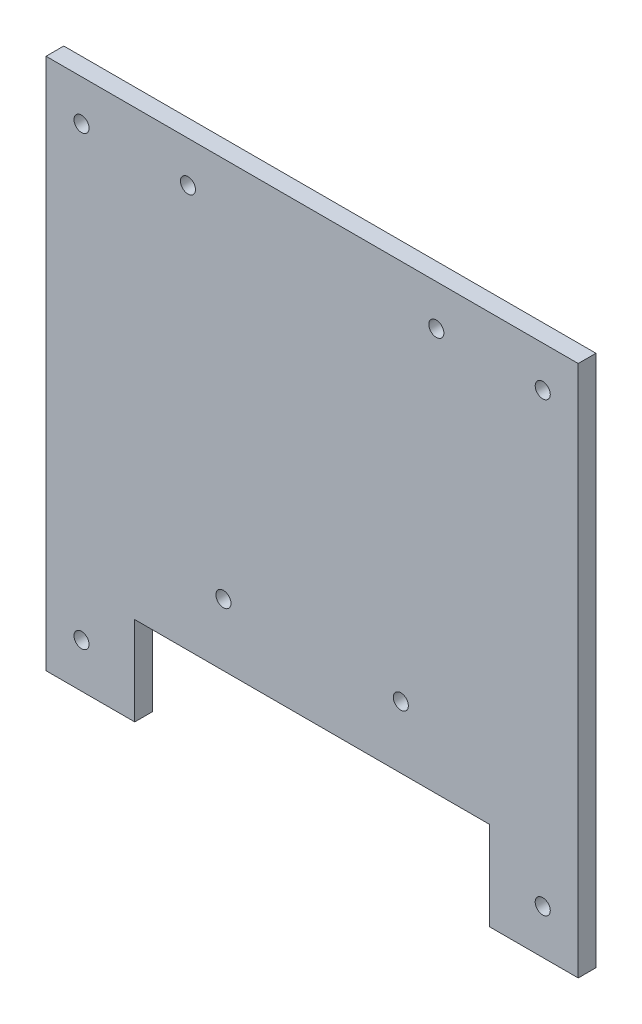
ISO-10303-21;
HEADER;
FILE_DESCRIPTION(('STEP AP214'),'2;1');
FILE_NAME('part.step','',(''),(''),'','','');
FILE_SCHEMA(('AUTOMOTIVE_DESIGN { 1 0 10303 214 1 1 1 1 }'));
ENDSEC;
DATA;
#1=APPLICATION_CONTEXT('core data for automotive mechanical design processes');
#2=APPLICATION_PROTOCOL_DEFINITION('international standard','automotive_design',2000,#1);
#3=PRODUCT_CONTEXT('',#1,'mechanical');
#4=PRODUCT('Part','Part','',(#3));
#5=PRODUCT_RELATED_PRODUCT_CATEGORY('part','',(#4));
#6=PRODUCT_DEFINITION_FORMATION('','',#4);
#7=PRODUCT_DEFINITION_CONTEXT('part definition',#1,'design');
#8=PRODUCT_DEFINITION('design','',#6,#7);
#9=PRODUCT_DEFINITION_SHAPE('','',#8);
#10=(LENGTH_UNIT() NAMED_UNIT(*) SI_UNIT(.MILLI.,.METRE.));
#11=(NAMED_UNIT(*) PLANE_ANGLE_UNIT() SI_UNIT($,.RADIAN.));
#12=(NAMED_UNIT(*) SI_UNIT($,.STERADIAN.) SOLID_ANGLE_UNIT());
#13=UNCERTAINTY_MEASURE_WITH_UNIT(LENGTH_MEASURE(1.E-05),#10,'distance_accuracy_value','');
#14=(GEOMETRIC_REPRESENTATION_CONTEXT(3) GLOBAL_UNCERTAINTY_ASSIGNED_CONTEXT((#13)) GLOBAL_UNIT_ASSIGNED_CONTEXT((#10,
#11,#12)) REPRESENTATION_CONTEXT('',''));
#15=CARTESIAN_POINT('',(0.,0.,0.));
#16=DIRECTION('',(0.,0.,1.));
#17=DIRECTION('',(1.,0.,0.));
#18=AXIS2_PLACEMENT_3D('',#15,#16,#17);
#19=CARTESIAN_POINT('',(-300.,0.,10.));
#20=DIRECTION('',(1.,0.,0.));
#21=DIRECTION('',(0.,0.,-1.));
#22=AXIS2_PLACEMENT_3D('',#19,#20,#21);
#23=PLANE('',#22);
#24=DIRECTION('',(0.,-1.,0.));
#25=VECTOR('',#24,1.);
#26=CARTESIAN_POINT('',(-300.,0.,0.));
#27=LINE('',#26,#25);
#28=CARTESIAN_POINT('',(-300.,300.,0.));
#29=VERTEX_POINT('',#28);
#30=CARTESIAN_POINT('',(-300.,0.,0.));
#31=VERTEX_POINT('',#30);
#32=EDGE_CURVE('E130',#29,#31,#27,.T.);
#33=ORIENTED_EDGE('',*,*,#32,.T.);
#34=DIRECTION('',(0.,0.,-1.));
#35=VECTOR('',#34,1.);
#36=CARTESIAN_POINT('',(-300.,0.,10.));
#37=LINE('',#36,#35);
#38=CARTESIAN_POINT('',(-300.,0.,10.));
#39=VERTEX_POINT('',#38);
#40=EDGE_CURVE('E11',#39,#31,#37,.T.);
#41=ORIENTED_EDGE('',*,*,#40,.F.);
#42=DIRECTION('',(0.,-1.,0.));
#43=VECTOR('',#42,1.);
#44=CARTESIAN_POINT('',(-300.,0.,10.));
#45=LINE('',#44,#43);
#46=CARTESIAN_POINT('',(-300.,300.,10.));
#47=VERTEX_POINT('',#46);
#48=EDGE_CURVE('E145',#47,#39,#45,.T.);
#49=ORIENTED_EDGE('',*,*,#48,.F.);
#50=DIRECTION('',(0.,0.,-1.));
#51=VECTOR('',#50,1.);
#52=CARTESIAN_POINT('',(-300.,300.,10.));
#53=LINE('',#52,#51);
#54=EDGE_CURVE('E126',#47,#29,#53,.T.);
#55=ORIENTED_EDGE('',*,*,#54,.T.);
#56=EDGE_LOOP('',(#33,#41,#49,#55));
#57=FACE_BOUND('',#56,.T.);
#58=ADVANCED_FACE('F34',(#57),#23,.F.);
#59=CARTESIAN_POINT('',(-300.,0.,10.));
#60=DIRECTION('',(0.,1.,0.));
#61=DIRECTION('',(0.,0.,1.));
#62=AXIS2_PLACEMENT_3D('',#59,#60,#61);
#63=PLANE('',#62);
#64=DIRECTION('',(1.,0.,0.));
#65=VECTOR('',#64,1.);
#66=CARTESIAN_POINT('',(-300.,0.,0.));
#67=LINE('',#66,#65);
#68=CARTESIAN_POINT('',(-250.,0.,0.));
#69=VERTEX_POINT('',#68);
#70=EDGE_CURVE('E133',#31,#69,#67,.T.);
#71=ORIENTED_EDGE('',*,*,#70,.T.);
#72=DIRECTION('',(0.,0.,-1.));
#73=VECTOR('',#72,1.);
#74=CARTESIAN_POINT('',(-250.,0.,10.));
#75=LINE('',#74,#73);
#76=CARTESIAN_POINT('',(-250.,0.,10.));
#77=VERTEX_POINT('',#76);
#78=EDGE_CURVE('E42',#77,#69,#75,.T.);
#79=ORIENTED_EDGE('',*,*,#78,.F.);
#80=DIRECTION('',(1.,0.,0.));
#81=VECTOR('',#80,1.);
#82=CARTESIAN_POINT('',(-300.,0.,10.));
#83=LINE('',#82,#81);
#84=EDGE_CURVE('E93',#39,#77,#83,.T.);
#85=ORIENTED_EDGE('',*,*,#84,.F.);
#86=ORIENTED_EDGE('',*,*,#40,.T.);
#87=EDGE_LOOP('',(#71,#79,#85,#86));
#88=FACE_BOUND('',#87,.T.);
#89=ADVANCED_FACE('F269',(#88),#63,.F.);
#90=CARTESIAN_POINT('',(-250.,0.,10.));
#91=DIRECTION('',(-1.,0.,0.));
#92=DIRECTION('',(0.,0.,1.));
#93=AXIS2_PLACEMENT_3D('',#90,#91,#92);
#94=PLANE('',#93);
#95=DIRECTION('',(0.,1.,0.));
#96=VECTOR('',#95,1.);
#97=CARTESIAN_POINT('',(-250.,0.,0.));
#98=LINE('',#97,#96);
#99=CARTESIAN_POINT('',(-250.,50.,0.));
#100=VERTEX_POINT('',#99);
#101=EDGE_CURVE('E136',#69,#100,#98,.T.);
#102=ORIENTED_EDGE('',*,*,#101,.T.);
#103=DIRECTION('',(0.,0.,-1.));
#104=VECTOR('',#103,1.);
#105=CARTESIAN_POINT('',(-250.,50.,10.));
#106=LINE('',#105,#104);
#107=CARTESIAN_POINT('',(-250.,50.,10.));
#108=VERTEX_POINT('',#107);
#109=EDGE_CURVE('E152',#108,#100,#106,.T.);
#110=ORIENTED_EDGE('',*,*,#109,.F.);
#111=DIRECTION('',(0.,1.,0.));
#112=VECTOR('',#111,1.);
#113=CARTESIAN_POINT('',(-250.,0.,10.));
#114=LINE('',#113,#112);
#115=EDGE_CURVE('E160',#77,#108,#114,.T.);
#116=ORIENTED_EDGE('',*,*,#115,.F.);
#117=ORIENTED_EDGE('',*,*,#78,.T.);
#118=EDGE_LOOP('',(#102,#110,#116,#117));
#119=FACE_BOUND('',#118,.T.);
#120=ADVANCED_FACE('F158',(#119),#94,.F.);
#121=CARTESIAN_POINT('',(-250.,50.,10.));
#122=DIRECTION('',(0.,1.,0.));
#123=DIRECTION('',(0.,0.,1.));
#124=AXIS2_PLACEMENT_3D('',#121,#122,#123);
#125=PLANE('',#124);
#126=DIRECTION('',(1.,0.,0.));
#127=VECTOR('',#126,1.);
#128=CARTESIAN_POINT('',(-250.,50.,0.));
#129=LINE('',#128,#127);
#130=CARTESIAN_POINT('',(-50.,50.,0.));
#131=VERTEX_POINT('',#130);
#132=EDGE_CURVE('E138',#100,#131,#129,.T.);
#133=ORIENTED_EDGE('',*,*,#132,.T.);
#134=DIRECTION('',(0.,0.,-1.));
#135=VECTOR('',#134,1.);
#136=CARTESIAN_POINT('',(-50.,50.,10.));
#137=LINE('',#136,#135);
#138=CARTESIAN_POINT('',(-50.,50.,10.));
#139=VERTEX_POINT('',#138);
#140=EDGE_CURVE('E149',#139,#131,#137,.T.);
#141=ORIENTED_EDGE('',*,*,#140,.F.);
#142=DIRECTION('',(1.,0.,0.));
#143=VECTOR('',#142,1.);
#144=CARTESIAN_POINT('',(-250.,50.,10.));
#145=LINE('',#144,#143);
#146=EDGE_CURVE('E172',#108,#139,#145,.T.);
#147=ORIENTED_EDGE('',*,*,#146,.F.);
#148=ORIENTED_EDGE('',*,*,#109,.T.);
#149=EDGE_LOOP('',(#133,#141,#147,#148));
#150=FACE_BOUND('',#149,.T.);
#151=ADVANCED_FACE('F168',(#150),#125,.F.);
#152=CARTESIAN_POINT('',(-50.,50.,10.));
#153=DIRECTION('',(1.,0.,0.));
#154=DIRECTION('',(0.,0.,-1.));
#155=AXIS2_PLACEMENT_3D('',#152,#153,#154);
#156=PLANE('',#155);
#157=DIRECTION('',(0.,-1.,0.));
#158=VECTOR('',#157,1.);
#159=CARTESIAN_POINT('',(-50.,50.,0.));
#160=LINE('',#159,#158);
#161=CARTESIAN_POINT('',(-50.,0.,0.));
#162=VERTEX_POINT('',#161);
#163=EDGE_CURVE('E140',#131,#162,#160,.T.);
#164=ORIENTED_EDGE('',*,*,#163,.T.);
#165=DIRECTION('',(0.,0.,-1.));
#166=VECTOR('',#165,1.);
#167=CARTESIAN_POINT('',(-50.,0.,10.));
#168=LINE('',#167,#166);
#169=CARTESIAN_POINT('',(-50.,0.,10.));
#170=VERTEX_POINT('',#169);
#171=EDGE_CURVE('E121',#170,#162,#168,.T.);
#172=ORIENTED_EDGE('',*,*,#171,.F.);
#173=DIRECTION('',(0.,-1.,0.));
#174=VECTOR('',#173,1.);
#175=CARTESIAN_POINT('',(-50.,50.,10.));
#176=LINE('',#175,#174);
#177=EDGE_CURVE('E112',#139,#170,#176,.T.);
#178=ORIENTED_EDGE('',*,*,#177,.F.);
#179=ORIENTED_EDGE('',*,*,#140,.T.);
#180=EDGE_LOOP('',(#164,#172,#178,#179));
#181=FACE_BOUND('',#180,.T.);
#182=ADVANCED_FACE('F171',(#181),#156,.F.);
#183=CARTESIAN_POINT('',(-50.,0.,10.));
#184=DIRECTION('',(0.,1.,0.));
#185=DIRECTION('',(0.,0.,1.));
#186=AXIS2_PLACEMENT_3D('',#183,#184,#185);
#187=PLANE('',#186);
#188=DIRECTION('',(1.,0.,0.));
#189=VECTOR('',#188,1.);
#190=CARTESIAN_POINT('',(-50.,0.,0.));
#191=LINE('',#190,#189);
#192=CARTESIAN_POINT('',(0.,0.,0.));
#193=VERTEX_POINT('',#192);
#194=EDGE_CURVE('E120',#162,#193,#191,.T.);
#195=ORIENTED_EDGE('',*,*,#194,.T.);
#196=DIRECTION('',(0.,0.,-1.));
#197=VECTOR('',#196,1.);
#198=CARTESIAN_POINT('',(0.,0.,10.));
#199=LINE('',#198,#197);
#200=CARTESIAN_POINT('',(0.,0.,10.));
#201=VERTEX_POINT('',#200);
#202=EDGE_CURVE('E117',#201,#193,#199,.T.);
#203=ORIENTED_EDGE('',*,*,#202,.F.);
#204=DIRECTION('',(1.,0.,0.));
#205=VECTOR('',#204,1.);
#206=CARTESIAN_POINT('',(-50.,0.,10.));
#207=LINE('',#206,#205);
#208=EDGE_CURVE('E106',#170,#201,#207,.T.);
#209=ORIENTED_EDGE('',*,*,#208,.F.);
#210=ORIENTED_EDGE('',*,*,#171,.T.);
#211=EDGE_LOOP('',(#195,#203,#209,#210));
#212=FACE_BOUND('',#211,.T.);
#213=ADVANCED_FACE('F118',(#212),#187,.F.);
#214=CARTESIAN_POINT('',(0.,0.,10.));
#215=DIRECTION('',(-1.,0.,0.));
#216=DIRECTION('',(0.,0.,1.));
#217=AXIS2_PLACEMENT_3D('',#214,#215,#216);
#218=PLANE('',#217);
#219=DIRECTION('',(0.,1.,0.));
#220=VECTOR('',#219,1.);
#221=CARTESIAN_POINT('',(0.,0.,0.));
#222=LINE('',#221,#220);
#223=CARTESIAN_POINT('',(0.,300.,0.));
#224=VERTEX_POINT('',#223);
#225=EDGE_CURVE('E79',#193,#224,#222,.T.);
#226=ORIENTED_EDGE('',*,*,#225,.T.);
#227=DIRECTION('',(0.,0.,-1.));
#228=VECTOR('',#227,1.);
#229=CARTESIAN_POINT('',(0.,300.,10.));
#230=LINE('',#229,#228);
#231=CARTESIAN_POINT('',(0.,300.,10.));
#232=VERTEX_POINT('',#231);
#233=EDGE_CURVE('E122',#232,#224,#230,.T.);
#234=ORIENTED_EDGE('',*,*,#233,.F.);
#235=DIRECTION('',(0.,1.,0.));
#236=VECTOR('',#235,1.);
#237=CARTESIAN_POINT('',(0.,0.,10.));
#238=LINE('',#237,#236);
#239=EDGE_CURVE('E110',#201,#232,#238,.T.);
#240=ORIENTED_EDGE('',*,*,#239,.F.);
#241=ORIENTED_EDGE('',*,*,#202,.T.);
#242=EDGE_LOOP('',(#226,#234,#240,#241));
#243=FACE_BOUND('',#242,.T.);
#244=ADVANCED_FACE('F124',(#243),#218,.F.);
#245=CARTESIAN_POINT('',(-300.,300.,10.));
#246=DIRECTION('',(0.,-1.,0.));
#247=DIRECTION('',(0.,0.,-1.));
#248=AXIS2_PLACEMENT_3D('',#245,#246,#247);
#249=PLANE('',#248);
#250=DIRECTION('',(-1.,0.,0.));
#251=VECTOR('',#250,1.);
#252=CARTESIAN_POINT('',(-300.,300.,0.));
#253=LINE('',#252,#251);
#254=EDGE_CURVE('E85',#224,#29,#253,.T.);
#255=ORIENTED_EDGE('',*,*,#254,.T.);
#256=ORIENTED_EDGE('',*,*,#54,.F.);
#257=DIRECTION('',(-1.,0.,0.));
#258=VECTOR('',#257,1.);
#259=CARTESIAN_POINT('',(-300.,300.,10.));
#260=LINE('',#259,#258);
#261=EDGE_CURVE('E50',#232,#47,#260,.T.);
#262=ORIENTED_EDGE('',*,*,#261,.F.);
#263=ORIENTED_EDGE('',*,*,#233,.T.);
#264=EDGE_LOOP('',(#255,#256,#262,#263));
#265=FACE_BOUND('',#264,.T.);
#266=ADVANCED_FACE('F237',(#265),#249,.F.);
#267=CARTESIAN_POINT('',(0.,0.,10.));
#268=DIRECTION('',(0.,0.,-1.));
#269=DIRECTION('',(-1.,0.,0.));
#270=AXIS2_PLACEMENT_3D('',#267,#268,#269);
#271=PLANE('',#270);
#272=CARTESIAN_POINT('',(-200.,85.,10.));
#273=DIRECTION('',(0.,0.,1.));
#274=DIRECTION('',(1.,0.,0.));
#275=AXIS2_PLACEMENT_3D('',#272,#273,#274);
#276=CIRCLE('',#275,4.24999999999995);
#277=CARTESIAN_POINT('',(-195.75,85.,10.));
#278=VERTEX_POINT('',#277);
#279=EDGE_CURVE('E220',#278,#278,#276,.T.);
#280=ORIENTED_EDGE('',*,*,#279,.F.);
#281=EDGE_LOOP('',(#280));
#282=FACE_BOUND('',#281,.T.);
#283=CARTESIAN_POINT('',(-100.,85.,10.));
#284=DIRECTION('',(0.,0.,1.));
#285=DIRECTION('',(1.,0.,0.));
#286=AXIS2_PLACEMENT_3D('',#283,#284,#285);
#287=CIRCLE('',#286,4.25000000000001);
#288=CARTESIAN_POINT('',(-95.75,85.,10.));
#289=VERTEX_POINT('',#288);
#290=EDGE_CURVE('E214',#289,#289,#287,.T.);
#291=ORIENTED_EDGE('',*,*,#290,.F.);
#292=EDGE_LOOP('',(#291));
#293=FACE_BOUND('',#292,.T.);
#294=CARTESIAN_POINT('',(-20.,277.,10.));
#295=DIRECTION('',(0.,0.,1.));
#296=DIRECTION('',(1.,0.,0.));
#297=AXIS2_PLACEMENT_3D('',#294,#295,#296);
#298=CIRCLE('',#297,4.25);
#299=CARTESIAN_POINT('',(-15.75,277.,10.));
#300=VERTEX_POINT('',#299);
#301=EDGE_CURVE('E209',#300,#300,#298,.T.);
#302=ORIENTED_EDGE('',*,*,#301,.F.);
#303=EDGE_LOOP('',(#302));
#304=FACE_BOUND('',#303,.T.);
#305=CARTESIAN_POINT('',(-20.,25.,10.));
#306=DIRECTION('',(0.,0.,1.));
#307=DIRECTION('',(1.,0.,0.));
#308=AXIS2_PLACEMENT_3D('',#305,#306,#307);
#309=CIRCLE('',#308,4.25);
#310=CARTESIAN_POINT('',(-15.75,25.,10.));
#311=VERTEX_POINT('',#310);
#312=EDGE_CURVE('E202',#311,#311,#309,.T.);
#313=ORIENTED_EDGE('',*,*,#312,.F.);
#314=EDGE_LOOP('',(#313));
#315=FACE_BOUND('',#314,.T.);
#316=CARTESIAN_POINT('',(-220.,277.,10.));
#317=DIRECTION('',(0.,0.,1.));
#318=DIRECTION('',(1.,0.,0.));
#319=AXIS2_PLACEMENT_3D('',#316,#317,#318);
#320=CIRCLE('',#319,4.24999999999995);
#321=CARTESIAN_POINT('',(-215.75,277.,10.));
#322=VERTEX_POINT('',#321);
#323=EDGE_CURVE('E184',#322,#322,#320,.T.);
#324=ORIENTED_EDGE('',*,*,#323,.F.);
#325=EDGE_LOOP('',(#324));
#326=FACE_BOUND('',#325,.T.);
#327=CARTESIAN_POINT('',(-80.,277.,10.));
#328=DIRECTION('',(0.,0.,1.));
#329=DIRECTION('',(1.,0.,0.));
#330=AXIS2_PLACEMENT_3D('',#327,#328,#329);
#331=CIRCLE('',#330,4.25000000000001);
#332=CARTESIAN_POINT('',(-75.75,277.,10.));
#333=VERTEX_POINT('',#332);
#334=EDGE_CURVE('E191',#333,#333,#331,.T.);
#335=ORIENTED_EDGE('',*,*,#334,.F.);
#336=EDGE_LOOP('',(#335));
#337=FACE_BOUND('',#336,.T.);
#338=CARTESIAN_POINT('',(-280.,277.,10.));
#339=DIRECTION('',(0.,0.,1.));
#340=DIRECTION('',(1.,0.,0.));
#341=AXIS2_PLACEMENT_3D('',#338,#339,#340);
#342=CIRCLE('',#341,4.25000000000001);
#343=CARTESIAN_POINT('',(-275.75,277.,10.));
#344=VERTEX_POINT('',#343);
#345=EDGE_CURVE('E197',#344,#344,#342,.T.);
#346=ORIENTED_EDGE('',*,*,#345,.F.);
#347=EDGE_LOOP('',(#346));
#348=FACE_BOUND('',#347,.T.);
#349=CARTESIAN_POINT('',(-280.,25.,10.));
#350=DIRECTION('',(0.,0.,1.));
#351=DIRECTION('',(1.,0.,0.));
#352=AXIS2_PLACEMENT_3D('',#349,#350,#351);
#353=CIRCLE('',#352,4.24999999999995);
#354=CARTESIAN_POINT('',(-275.75,25.,10.));
#355=VERTEX_POINT('',#354);
#356=EDGE_CURVE('E178',#355,#355,#353,.T.);
#357=ORIENTED_EDGE('',*,*,#356,.F.);
#358=EDGE_LOOP('',(#357));
#359=FACE_BOUND('',#358,.T.);
#360=ORIENTED_EDGE('',*,*,#48,.T.);
#361=ORIENTED_EDGE('',*,*,#84,.T.);
#362=ORIENTED_EDGE('',*,*,#115,.T.);
#363=ORIENTED_EDGE('',*,*,#146,.T.);
#364=ORIENTED_EDGE('',*,*,#177,.T.);
#365=ORIENTED_EDGE('',*,*,#208,.T.);
#366=ORIENTED_EDGE('',*,*,#239,.T.);
#367=ORIENTED_EDGE('',*,*,#261,.T.);
#368=EDGE_LOOP('',(#360,#361,#362,#363,#364,#365,#366,#367));
#369=FACE_BOUND('',#368,.T.);
#370=ADVANCED_FACE('F108',(#282,#293,#304,#315,#326,#337,#348,#359,#369),#271,.F.);
#371=CARTESIAN_POINT('',(0.,0.,0.));
#372=DIRECTION('',(0.,0.,-1.));
#373=DIRECTION('',(-1.,0.,0.));
#374=AXIS2_PLACEMENT_3D('',#371,#372,#373);
#375=PLANE('',#374);
#376=CARTESIAN_POINT('',(-200.,85.,0.));
#377=DIRECTION('',(0.,0.,1.));
#378=DIRECTION('',(1.,0.,0.));
#379=AXIS2_PLACEMENT_3D('',#376,#377,#378);
#380=CIRCLE('',#379,4.24999999999995);
#381=CARTESIAN_POINT('',(-195.75,85.,0.));
#382=VERTEX_POINT('',#381);
#383=EDGE_CURVE('E217',#382,#382,#380,.T.);
#384=ORIENTED_EDGE('',*,*,#383,.T.);
#385=EDGE_LOOP('',(#384));
#386=FACE_BOUND('',#385,.T.);
#387=CARTESIAN_POINT('',(-100.,85.,0.));
#388=DIRECTION('',(0.,0.,1.));
#389=DIRECTION('',(1.,0.,0.));
#390=AXIS2_PLACEMENT_3D('',#387,#388,#389);
#391=CIRCLE('',#390,4.25000000000001);
#392=CARTESIAN_POINT('',(-95.75,85.,0.));
#393=VERTEX_POINT('',#392);
#394=EDGE_CURVE('E206',#393,#393,#391,.T.);
#395=ORIENTED_EDGE('',*,*,#394,.T.);
#396=EDGE_LOOP('',(#395));
#397=FACE_BOUND('',#396,.T.);
#398=CARTESIAN_POINT('',(-20.,277.,0.));
#399=DIRECTION('',(0.,0.,1.));
#400=DIRECTION('',(1.,0.,0.));
#401=AXIS2_PLACEMENT_3D('',#398,#399,#400);
#402=CIRCLE('',#401,4.25);
#403=CARTESIAN_POINT('',(-15.75,277.,0.));
#404=VERTEX_POINT('',#403);
#405=EDGE_CURVE('E188',#404,#404,#402,.T.);
#406=ORIENTED_EDGE('',*,*,#405,.T.);
#407=EDGE_LOOP('',(#406));
#408=FACE_BOUND('',#407,.T.);
#409=CARTESIAN_POINT('',(-20.,25.,0.));
#410=DIRECTION('',(0.,0.,1.));
#411=DIRECTION('',(1.,0.,0.));
#412=AXIS2_PLACEMENT_3D('',#409,#410,#411);
#413=CIRCLE('',#412,4.25);
#414=CARTESIAN_POINT('',(-15.75,25.,0.));
#415=VERTEX_POINT('',#414);
#416=EDGE_CURVE('E205',#415,#415,#413,.T.);
#417=ORIENTED_EDGE('',*,*,#416,.T.);
#418=EDGE_LOOP('',(#417));
#419=FACE_BOUND('',#418,.T.);
#420=CARTESIAN_POINT('',(-220.,277.,0.));
#421=DIRECTION('',(0.,0.,1.));
#422=DIRECTION('',(1.,0.,0.));
#423=AXIS2_PLACEMENT_3D('',#420,#421,#422);
#424=CIRCLE('',#423,4.24999999999995);
#425=CARTESIAN_POINT('',(-215.75,277.,0.));
#426=VERTEX_POINT('',#425);
#427=EDGE_CURVE('E187',#426,#426,#424,.T.);
#428=ORIENTED_EDGE('',*,*,#427,.T.);
#429=EDGE_LOOP('',(#428));
#430=FACE_BOUND('',#429,.T.);
#431=CARTESIAN_POINT('',(-80.,277.,0.));
#432=DIRECTION('',(0.,0.,1.));
#433=DIRECTION('',(1.,0.,0.));
#434=AXIS2_PLACEMENT_3D('',#431,#432,#433);
#435=CIRCLE('',#434,4.25000000000001);
#436=CARTESIAN_POINT('',(-75.75,277.,0.));
#437=VERTEX_POINT('',#436);
#438=EDGE_CURVE('E194',#437,#437,#435,.T.);
#439=ORIENTED_EDGE('',*,*,#438,.T.);
#440=EDGE_LOOP('',(#439));
#441=FACE_BOUND('',#440,.T.);
#442=CARTESIAN_POINT('',(-280.,277.,0.));
#443=DIRECTION('',(0.,0.,1.));
#444=DIRECTION('',(1.,0.,0.));
#445=AXIS2_PLACEMENT_3D('',#442,#443,#444);
#446=CIRCLE('',#445,4.25000000000001);
#447=CARTESIAN_POINT('',(-275.75,277.,0.));
#448=VERTEX_POINT('',#447);
#449=EDGE_CURVE('E181',#448,#448,#446,.T.);
#450=ORIENTED_EDGE('',*,*,#449,.T.);
#451=EDGE_LOOP('',(#450));
#452=FACE_BOUND('',#451,.T.);
#453=CARTESIAN_POINT('',(-280.,25.,0.));
#454=DIRECTION('',(0.,0.,1.));
#455=DIRECTION('',(1.,0.,0.));
#456=AXIS2_PLACEMENT_3D('',#453,#454,#455);
#457=CIRCLE('',#456,4.24999999999995);
#458=CARTESIAN_POINT('',(-275.75,25.,0.));
#459=VERTEX_POINT('',#458);
#460=EDGE_CURVE('E134',#459,#459,#457,.T.);
#461=ORIENTED_EDGE('',*,*,#460,.T.);
#462=EDGE_LOOP('',(#461));
#463=FACE_BOUND('',#462,.T.);
#464=ORIENTED_EDGE('',*,*,#32,.F.);
#465=ORIENTED_EDGE('',*,*,#254,.F.);
#466=ORIENTED_EDGE('',*,*,#225,.F.);
#467=ORIENTED_EDGE('',*,*,#194,.F.);
#468=ORIENTED_EDGE('',*,*,#163,.F.);
#469=ORIENTED_EDGE('',*,*,#132,.F.);
#470=ORIENTED_EDGE('',*,*,#101,.F.);
#471=ORIENTED_EDGE('',*,*,#70,.F.);
#472=EDGE_LOOP('',(#464,#465,#466,#467,#468,#469,#470,#471));
#473=FACE_BOUND('',#472,.T.);
#474=ADVANCED_FACE('F164',(#386,#397,#408,#419,#430,#441,#452,#463,#473),#375,.T.);
#475=CARTESIAN_POINT('',(-280.,25.,0.));
#476=DIRECTION('',(0.,0.,1.));
#477=DIRECTION('',(1.,0.,0.));
#478=AXIS2_PLACEMENT_3D('',#475,#476,#477);
#479=CYLINDRICAL_SURFACE('',#478,4.24999999999995);
#480=ORIENTED_EDGE('',*,*,#460,.F.);
#481=EDGE_LOOP('',(#480));
#482=FACE_BOUND('',#481,.T.);
#483=ORIENTED_EDGE('',*,*,#356,.T.);
#484=EDGE_LOOP('',(#483));
#485=FACE_BOUND('',#484,.T.);
#486=ADVANCED_FACE('F253',(#482,#485),#479,.F.);
#487=CARTESIAN_POINT('',(-280.,277.,0.));
#488=DIRECTION('',(0.,0.,1.));
#489=DIRECTION('',(1.,0.,0.));
#490=AXIS2_PLACEMENT_3D('',#487,#488,#489);
#491=CYLINDRICAL_SURFACE('',#490,4.25000000000001);
#492=ORIENTED_EDGE('',*,*,#449,.F.);
#493=EDGE_LOOP('',(#492));
#494=FACE_BOUND('',#493,.T.);
#495=ORIENTED_EDGE('',*,*,#345,.T.);
#496=EDGE_LOOP('',(#495));
#497=FACE_BOUND('',#496,.T.);
#498=ADVANCED_FACE('F255',(#494,#497),#491,.F.);
#499=CARTESIAN_POINT('',(-80.,277.,0.));
#500=DIRECTION('',(0.,0.,1.));
#501=DIRECTION('',(1.,0.,0.));
#502=AXIS2_PLACEMENT_3D('',#499,#500,#501);
#503=CYLINDRICAL_SURFACE('',#502,4.25000000000001);
#504=ORIENTED_EDGE('',*,*,#438,.F.);
#505=EDGE_LOOP('',(#504));
#506=FACE_BOUND('',#505,.T.);
#507=ORIENTED_EDGE('',*,*,#334,.T.);
#508=EDGE_LOOP('',(#507));
#509=FACE_BOUND('',#508,.T.);
#510=ADVANCED_FACE('F262',(#506,#509),#503,.F.);
#511=CARTESIAN_POINT('',(-220.,277.,0.));
#512=DIRECTION('',(0.,0.,1.));
#513=DIRECTION('',(1.,0.,0.));
#514=AXIS2_PLACEMENT_3D('',#511,#512,#513);
#515=CYLINDRICAL_SURFACE('',#514,4.24999999999995);
#516=ORIENTED_EDGE('',*,*,#427,.F.);
#517=EDGE_LOOP('',(#516));
#518=FACE_BOUND('',#517,.T.);
#519=ORIENTED_EDGE('',*,*,#323,.T.);
#520=EDGE_LOOP('',(#519));
#521=FACE_BOUND('',#520,.T.);
#522=ADVANCED_FACE('F335',(#518,#521),#515,.F.);
#523=CARTESIAN_POINT('',(-20.,25.,0.));
#524=DIRECTION('',(0.,0.,1.));
#525=DIRECTION('',(1.,0.,0.));
#526=AXIS2_PLACEMENT_3D('',#523,#524,#525);
#527=CYLINDRICAL_SURFACE('',#526,4.25);
#528=ORIENTED_EDGE('',*,*,#416,.F.);
#529=EDGE_LOOP('',(#528));
#530=FACE_BOUND('',#529,.T.);
#531=ORIENTED_EDGE('',*,*,#312,.T.);
#532=EDGE_LOOP('',(#531));
#533=FACE_BOUND('',#532,.T.);
#534=ADVANCED_FACE('F345',(#530,#533),#527,.F.);
#535=CARTESIAN_POINT('',(-20.,277.,0.));
#536=DIRECTION('',(0.,0.,1.));
#537=DIRECTION('',(1.,0.,0.));
#538=AXIS2_PLACEMENT_3D('',#535,#536,#537);
#539=CYLINDRICAL_SURFACE('',#538,4.25);
#540=ORIENTED_EDGE('',*,*,#405,.F.);
#541=EDGE_LOOP('',(#540));
#542=FACE_BOUND('',#541,.T.);
#543=ORIENTED_EDGE('',*,*,#301,.T.);
#544=EDGE_LOOP('',(#543));
#545=FACE_BOUND('',#544,.T.);
#546=ADVANCED_FACE('F354',(#542,#545),#539,.F.);
#547=CARTESIAN_POINT('',(-100.,85.,0.));
#548=DIRECTION('',(0.,0.,1.));
#549=DIRECTION('',(1.,0.,0.));
#550=AXIS2_PLACEMENT_3D('',#547,#548,#549);
#551=CYLINDRICAL_SURFACE('',#550,4.25000000000001);
#552=ORIENTED_EDGE('',*,*,#394,.F.);
#553=EDGE_LOOP('',(#552));
#554=FACE_BOUND('',#553,.T.);
#555=ORIENTED_EDGE('',*,*,#290,.T.);
#556=EDGE_LOOP('',(#555));
#557=FACE_BOUND('',#556,.T.);
#558=ADVANCED_FACE('F231',(#554,#557),#551,.F.);
#559=CARTESIAN_POINT('',(-200.,85.,0.));
#560=DIRECTION('',(0.,0.,1.));
#561=DIRECTION('',(1.,0.,0.));
#562=AXIS2_PLACEMENT_3D('',#559,#560,#561);
#563=CYLINDRICAL_SURFACE('',#562,4.24999999999995);
#564=ORIENTED_EDGE('',*,*,#383,.F.);
#565=EDGE_LOOP('',(#564));
#566=FACE_BOUND('',#565,.T.);
#567=ORIENTED_EDGE('',*,*,#279,.T.);
#568=EDGE_LOOP('',(#567));
#569=FACE_BOUND('',#568,.T.);
#570=ADVANCED_FACE('F228',(#566,#569),#563,.F.);
#571=CLOSED_SHELL('',(#58,#89,#120,#151,#182,#213,#244,#266,#370,#474,#486,#498,#510,#522,#534,
#546,#558,#570));
#572=MANIFOLD_SOLID_BREP('B2',#571);
#573=ADVANCED_BREP_SHAPE_REPRESENTATION('',(#18,#572),#14);
#574=SHAPE_DEFINITION_REPRESENTATION(#9,#573);
ENDSEC;
END-ISO-10303-21;
